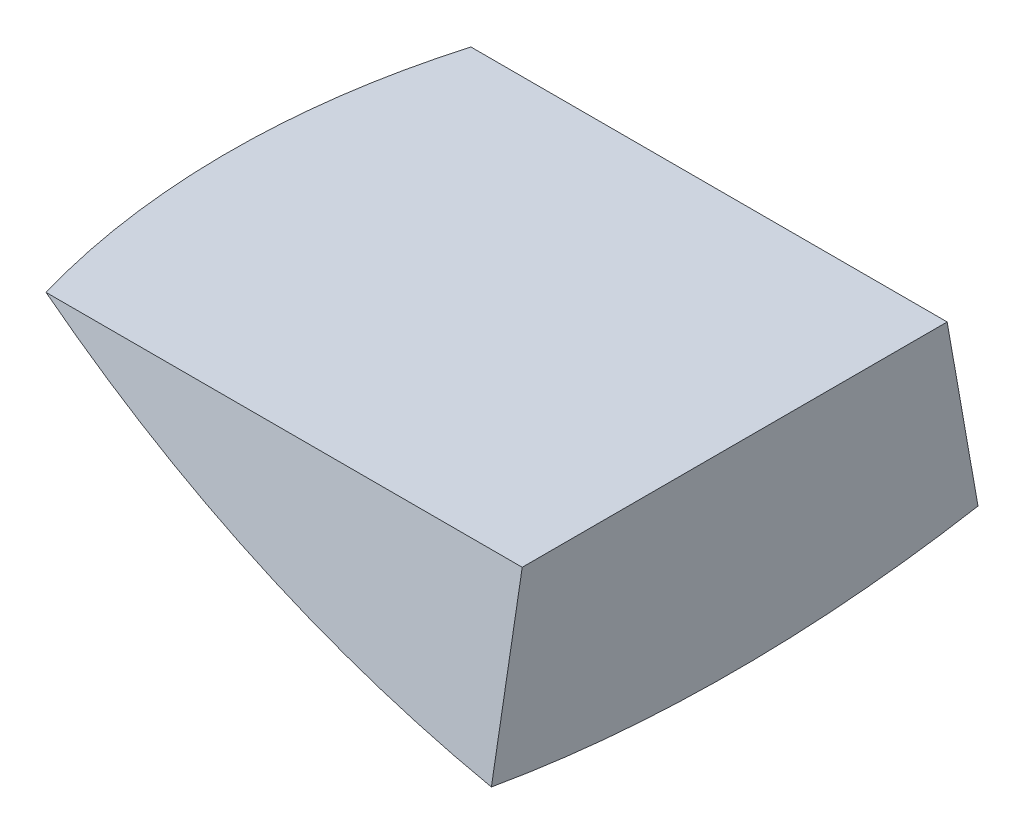
ISO-10303-21;
HEADER;
FILE_DESCRIPTION(('STEP AP214'),'2;1');
FILE_NAME('part.step','',(''),(''),'','','');
FILE_SCHEMA(('AUTOMOTIVE_DESIGN { 1 0 10303 214 1 1 1 1 }'));
ENDSEC;
DATA;
#1=APPLICATION_CONTEXT('core data for automotive mechanical design processes');
#2=APPLICATION_PROTOCOL_DEFINITION('international standard','automotive_design',2000,#1);
#3=PRODUCT_CONTEXT('',#1,'mechanical');
#4=PRODUCT('Part','Part','',(#3));
#5=PRODUCT_RELATED_PRODUCT_CATEGORY('part','',(#4));
#6=PRODUCT_DEFINITION_FORMATION('','',#4);
#7=PRODUCT_DEFINITION_CONTEXT('part definition',#1,'design');
#8=PRODUCT_DEFINITION('design','',#6,#7);
#9=PRODUCT_DEFINITION_SHAPE('','',#8);
#10=(LENGTH_UNIT() NAMED_UNIT(*) SI_UNIT(.MILLI.,.METRE.));
#11=(NAMED_UNIT(*) PLANE_ANGLE_UNIT() SI_UNIT($,.RADIAN.));
#12=(NAMED_UNIT(*) SI_UNIT($,.STERADIAN.) SOLID_ANGLE_UNIT());
#13=UNCERTAINTY_MEASURE_WITH_UNIT(LENGTH_MEASURE(1.E-05),#10,'distance_accuracy_value','');
#14=(GEOMETRIC_REPRESENTATION_CONTEXT(3) GLOBAL_UNCERTAINTY_ASSIGNED_CONTEXT((#13)) GLOBAL_UNIT_ASSIGNED_CONTEXT((#10,
#11,#12)) REPRESENTATION_CONTEXT('',''));
#15=CARTESIAN_POINT('',(0.,0.,0.));
#16=DIRECTION('',(0.,0.,1.));
#17=DIRECTION('',(1.,0.,0.));
#18=AXIS2_PLACEMENT_3D('',#15,#16,#17);
#19=CARTESIAN_POINT('',(-110.266592818501,-615.705846325504,110.266592818501));
#20=DIRECTION('',(-1.,0.,0.));
#21=DIRECTION('',(0.,-1.,0.));
#22=AXIS2_PLACEMENT_3D('',#19,#20,#21);
#23=PLANE('',#22);
#24=DIRECTION('',(0.,0.984807753012208,0.173648177666931));
#25=VECTOR('',#24,1.);
#26=CARTESIAN_POINT('',(-110.266592818501,-615.705846325504,-110.266592818501));
#27=LINE('',#26,#25);
#28=CARTESIAN_POINT('',(-110.266592818501,-615.705846325504,-110.266592818501));
#29=VERTEX_POINT('',#28);
#30=CARTESIAN_POINT('',(-110.266592818501,-536.452923162752,-96.2921641648929));
#31=VERTEX_POINT('',#30);
#32=EDGE_CURVE('E79',#29,#31,#27,.T.);
#33=ORIENTED_EDGE('',*,*,#32,.T.);
#34=DIRECTION('',(0.,0.,-1.));
#35=VECTOR('',#34,1.);
#36=CARTESIAN_POINT('',(-110.266592818501,-536.452923162752,217.297250177168));
#37=LINE('',#36,#35);
#38=CARTESIAN_POINT('',(-110.266592818501,-536.452923162752,96.292164164893));
#39=VERTEX_POINT('',#38);
#40=EDGE_CURVE('E48',#39,#31,#37,.T.);
#41=ORIENTED_EDGE('',*,*,#40,.F.);
#42=DIRECTION('',(0.,0.984807753012208,-0.173648177666931));
#43=VECTOR('',#42,1.);
#44=CARTESIAN_POINT('',(-110.266592818501,-615.705846325504,110.266592818501));
#45=LINE('',#44,#43);
#46=CARTESIAN_POINT('',(-110.266592818501,-615.705846325504,110.266592818501));
#47=VERTEX_POINT('',#46);
#48=EDGE_CURVE('E77',#47,#39,#45,.T.);
#49=ORIENTED_EDGE('',*,*,#48,.F.);
#50=CARTESIAN_POINT('',(-110.266592818501,9.64707683724784,0.));
#51=DIRECTION('',(1.,0.,0.));
#52=DIRECTION('',(0.,1.,0.));
#53=AXIS2_PLACEMENT_3D('',#50,#51,#52);
#54=CIRCLE('',#53,635.);
#55=EDGE_CURVE('E42',#47,#29,#54,.T.);
#56=ORIENTED_EDGE('',*,*,#55,.T.);
#57=EDGE_LOOP('',(#33,#41,#49,#56));
#58=FACE_BOUND('',#57,.T.);
#59=ADVANCED_FACE('F35',(#58),#23,.F.);
#60=CARTESIAN_POINT('',(0.,9.64707683724786,0.));
#61=DIRECTION('',(1.,0.,0.));
#62=DIRECTION('',(0.,1.,0.));
#63=AXIS2_PLACEMENT_3D('',#60,#61,#62);
#64=DEGENERATE_TOROIDAL_SURFACE('',#63,9.64707683724786,635.,.T.);
#65=CARTESIAN_POINT('',(0.,0.146560774021677,1.67519731260095));
#66=DIRECTION('',(0.,0.173648177666931,0.984807753012208));
#67=DIRECTION('',(-1.,0.,0.));
#68=AXIS2_PLACEMENT_3D('',#65,#66,#67);
#69=CIRCLE('',#68,635.);
#70=CARTESIAN_POINT('',(-326.088367505589,-536.452923162752,96.2921641648928));
#71=VERTEX_POINT('',#70);
#72=EDGE_CURVE('E56',#71,#47,#69,.T.);
#73=ORIENTED_EDGE('',*,*,#72,.F.);
#74=CARTESIAN_POINT('',(-339.76942362452,-536.452923162752,0.));
#75=CARTESIAN_POINT('',(-339.769428722978,-536.452923162752,-4.84295463833446));
#76=CARTESIAN_POINT('',(-339.667699387488,-536.452923162752,-9.68575502193584));
#77=CARTESIAN_POINT('',(-339.26094606988,-536.452923162752,-19.3632294432714));
#78=CARTESIAN_POINT('',(-338.955908021492,-536.452923162752,-24.1979028955253));
#79=CARTESIAN_POINT('',(-338.142922552507,-536.452923162752,-33.8512465812276));
#80=CARTESIAN_POINT('',(-337.634928958928,-536.452923162752,-38.6699129213052));
#81=CARTESIAN_POINT('',(-336.416866039196,-536.452923162752,-48.2816378453036));
#82=CARTESIAN_POINT('',(-335.706796959014,-536.452923162752,-53.0746964603873));
#83=CARTESIAN_POINT('',(-334.084850237135,-536.452923162752,-62.6319996861504));
#84=CARTESIAN_POINT('',(-333.172750315264,-536.452923162752,-67.3962065756387));
#85=CARTESIAN_POINT('',(-331.148692751065,-536.452923162752,-76.8820018702564));
#86=CARTESIAN_POINT('',(-330.036734109234,-536.452923162752,-81.6035900621237));
#87=CARTESIAN_POINT('',(-327.614884685211,-536.452923162752,-90.9953890879961));
#88=CARTESIAN_POINT('',(-326.30500730234,-536.452923162752,-95.6656033771268));
#89=CARTESIAN_POINT('',(-323.489444811329,-536.452923162752,-104.946625772897));
#90=CARTESIAN_POINT('',(-321.983759973113,-536.452923162752,-109.557433961419));
#91=CARTESIAN_POINT('',(-318.779423735756,-536.452923162752,-118.710450079452));
#92=CARTESIAN_POINT('',(-317.080811757509,-536.452923162752,-123.252671809139));
#93=CARTESIAN_POINT('',(-313.493224636082,-536.452923162752,-132.261310051288));
#94=CARTESIAN_POINT('',(-311.604249431441,-536.452923162752,-136.727726539276));
#95=CARTESIAN_POINT('',(-307.639091792968,-536.452923162752,-145.576768922274));
#96=CARTESIAN_POINT('',(-305.562906128039,-536.452923162752,-149.959393369521));
#97=CARTESIAN_POINT('',(-301.226882249332,-536.452923162752,-158.632833162181));
#98=CARTESIAN_POINT('',(-298.967044072024,-536.452923162752,-162.923648525827));
#99=CARTESIAN_POINT('',(-294.268211252309,-536.452923162752,-171.404523640603));
#100=CARTESIAN_POINT('',(-291.829265162082,-536.452923162752,-175.59461029124));
#101=CARTESIAN_POINT('',(-286.775868821859,-536.452923162752,-183.867585083601));
#102=CARTESIAN_POINT('',(-284.161418539305,-536.452923162752,-187.950473205437));
#103=CARTESIAN_POINT('',(-278.76155239655,-536.452923162752,-196.001545735154));
#104=CARTESIAN_POINT('',(-275.97613771324,-536.452923162752,-199.969730932355));
#105=CARTESIAN_POINT('',(-270.239170949563,-536.452923162752,-207.784131640855));
#106=CARTESIAN_POINT('',(-267.287619015234,-536.452923162752,-211.630347259362));
#107=CARTESIAN_POINT('',(-261.237322810408,-536.452923162752,-219.176524102658));
#108=CARTESIAN_POINT('',(-258.139308500958,-536.452923162752,-222.877070603313));
#109=CARTESIAN_POINT('',(-251.789164051317,-536.452923162752,-230.143481893104));
#110=CARTESIAN_POINT('',(-248.537034040391,-536.452923162752,-233.7093467952));
#111=CARTESIAN_POINT('',(-241.884353827301,-536.452923162752,-240.699833788068));
#112=CARTESIAN_POINT('',(-238.483803589214,-536.452923162752,-244.124455844654));
#113=CARTESIAN_POINT('',(-231.540271132769,-536.452923162752,-250.826132869048));
#114=CARTESIAN_POINT('',(-227.997288898594,-536.452923162752,-254.10318782047));
#115=CARTESIAN_POINT('',(-220.775119439575,-536.452923162752,-260.503697600759));
#116=CARTESIAN_POINT('',(-217.095930605336,-536.452923162752,-263.627150613675));
#117=CARTESIAN_POINT('',(-209.607925862827,-536.452923162752,-269.714613541255));
#118=CARTESIAN_POINT('',(-205.799109908179,-536.452923162752,-272.678623398873));
#119=CARTESIAN_POINT('',(-198.058670393566,-536.452923162752,-278.441663368454));
#120=CARTESIAN_POINT('',(-194.12704740586,-536.452923162752,-281.240694249013));
#121=CARTESIAN_POINT('',(-186.14802650805,-536.452923162752,-286.668561262383));
#122=CARTESIAN_POINT('',(-182.100628782029,-536.452923162752,-289.297397665782));
#123=CARTESIAN_POINT('',(-173.931412726657,-536.452923162752,-294.358845280453));
#124=CARTESIAN_POINT('',(-169.810491758008,-536.452923162752,-296.79290496997));
#125=CARTESIAN_POINT('',(-161.469266169482,-536.452923162752,-301.484316973172));
#126=CARTESIAN_POINT('',(-157.248961704159,-536.452923162752,-303.741669561634));
#127=CARTESIAN_POINT('',(-148.716497131806,-536.452923162752,-308.075487899163));
#128=CARTESIAN_POINT('',(-144.404337398178,-536.452923162752,-310.151954383375));
#129=CARTESIAN_POINT('',(-135.695842215571,-536.452923162752,-314.120166713405));
#130=CARTESIAN_POINT('',(-131.299506739114,-536.452923162752,-316.011912498921));
#131=CARTESIAN_POINT('',(-122.430667060548,-536.452923162752,-319.607118279643));
#132=CARTESIAN_POINT('',(-117.95816520999,-536.452923162752,-321.310584075662));
#133=CARTESIAN_POINT('',(-108.944882024787,-536.452923162752,-324.526133357301));
#134=CARTESIAN_POINT('',(-104.404100677416,-536.452923162752,-326.038216807249));
#135=CARTESIAN_POINT('',(-95.2624311293848,-536.452923162752,-328.868185711657));
#136=CARTESIAN_POINT('',(-90.6615430644933,-536.452923162752,-330.186071604685));
#137=CARTESIAN_POINT('',(-81.4079355397135,-536.452923162752,-332.625195020947));
#138=CARTESIAN_POINT('',(-76.7552161379019,-536.452923162752,-333.7464327645));
#139=CARTESIAN_POINT('',(-67.4345544427315,-536.452923162752,-335.784002558927));
#140=CARTESIAN_POINT('',(-62.766873562757,-536.452923162752,-336.701530607992));
#141=CARTESIAN_POINT('',(-53.3969160719588,-536.452923162752,-338.338552286753));
#142=CARTESIAN_POINT('',(-48.6946395004366,-536.452923162752,-339.058046141384));
#143=CARTESIAN_POINT('',(-39.263899436132,-536.452923162752,-340.297671367925));
#144=CARTESIAN_POINT('',(-34.5354360432177,-536.452923162752,-340.817803499605));
#145=CARTESIAN_POINT('',(-25.0607490078317,-536.452923162752,-341.657750132317));
#146=CARTESIAN_POINT('',(-20.3145253606554,-536.452923162752,-341.977564580284));
#147=CARTESIAN_POINT('',(-10.8128882397411,-536.452923162752,-342.416281535476));
#148=CARTESIAN_POINT('',(-6.05747493539603,-536.452923162752,-342.535187711341));
#149=CARTESIAN_POINT('',(3.45412780300762,-536.452923162752,-342.57188006614));
#150=CARTESIAN_POINT('',(8.21031723709752,-536.452923162752,-342.489666236963));
#151=CARTESIAN_POINT('',(17.7149677675572,-536.452923162752,-342.124270383659));
#152=CARTESIAN_POINT('',(22.4634288671175,-536.452923162752,-341.841088442521));
#153=CARTESIAN_POINT('',(31.9441372053,-536.452923162752,-341.074278909072));
#154=CARTESIAN_POINT('',(36.6763844511052,-536.452923162752,-340.590651405575));
#155=CARTESIAN_POINT('',(46.1044769104672,-536.452923162752,-339.425293663173));
#156=CARTESIAN_POINT('',(50.8003833707214,-536.452923162752,-338.744058857033));
#157=CARTESIAN_POINT('',(60.1593096348347,-536.452923162752,-337.184276948185));
#158=CARTESIAN_POINT('',(64.8223294542933,-536.452923162752,-336.305729939077));
#159=CARTESIAN_POINT('',(74.1071967944428,-536.452923162752,-334.352936628233));
#160=CARTESIAN_POINT('',(78.7290444152358,-536.452923162752,-333.278690802437));
#161=CARTESIAN_POINT('',(87.9233867012715,-536.452923162752,-330.936466328788));
#162=CARTESIAN_POINT('',(92.4958813596242,-536.452923162752,-329.668487653889));
#163=CARTESIAN_POINT('',(101.583407220782,-536.452923162752,-326.941123161788));
#164=CARTESIAN_POINT('',(106.098438618762,-536.452923162752,-325.481737994888));
#165=CARTESIAN_POINT('',(115.063073885143,-536.452923162752,-322.374225810012));
#166=CARTESIAN_POINT('',(119.512677759442,-536.452923162752,-320.72609880905));
#167=CARTESIAN_POINT('',(128.338614528639,-536.452923162752,-317.244110724583));
#168=CARTESIAN_POINT('',(132.714947339825,-536.452923162752,-315.410249428892));
#169=CARTESIAN_POINT('',(141.3866341501,-536.452923162752,-311.560138631537));
#170=CARTESIAN_POINT('',(145.681988130142,-536.452923162752,-309.54388908697));
#171=CARTESIAN_POINT('',(154.189230749756,-536.452923162752,-305.330168754298));
#172=CARTESIAN_POINT('',(158.401014057928,-536.452923162752,-303.132485309371));
#173=CARTESIAN_POINT('',(166.728455021933,-536.452923162752,-298.561980588277));
#174=CARTESIAN_POINT('',(170.844112657973,-536.452923162752,-296.189159276048));
#175=CARTESIAN_POINT('',(178.97209517879,-536.452923162752,-291.272696440791));
#176=CARTESIAN_POINT('',(182.984420148641,-536.452923162752,-288.729055058407));
#177=CARTESIAN_POINT('',(190.898741077816,-536.452923162752,-283.475566827991));
#178=CARTESIAN_POINT('',(194.800737036183,-536.452923162752,-280.765719978517));
#179=CARTESIAN_POINT('',(202.487651136336,-536.452923162752,-275.184702813561));
#180=CARTESIAN_POINT('',(206.272568230706,-536.452923162752,-272.313531055474));
#181=CARTESIAN_POINT('',(213.718732512769,-536.452923162752,-266.415073407385));
#182=CARTESIAN_POINT('',(217.37997972648,-536.452923162752,-263.387787550229));
#183=CARTESIAN_POINT('',(224.572500300582,-536.452923162752,-257.182546805996));
#184=CARTESIAN_POINT('',(228.103773319766,-536.452923162752,-254.004591523433));
#185=CARTESIAN_POINT('',(235.030273374652,-536.452923162752,-247.50372752828));
#186=CARTESIAN_POINT('',(238.425500289788,-536.452923162752,-244.180818687233));
#187=CARTESIAN_POINT('',(245.090066853897,-536.452923162752,-237.379709890048));
#188=CARTESIAN_POINT('',(248.358723846882,-536.452923162752,-233.900840963183));
#189=CARTESIAN_POINT('',(254.747209671457,-536.452923162752,-226.809035166932));
#190=CARTESIAN_POINT('',(257.867038373266,-536.452923162752,-223.196098180642));
#191=CARTESIAN_POINT('',(263.952540006145,-536.452923162752,-215.842645863624));
#192=CARTESIAN_POINT('',(266.918212767112,-536.452923162752,-212.102130392127));
#193=CARTESIAN_POINT('',(272.690359416666,-536.452923162752,-204.500224006448));
#194=CARTESIAN_POINT('',(275.496833324763,-536.452923162752,-200.63883310708));
#195=CARTESIAN_POINT('',(280.945918441841,-536.452923162752,-192.801954482027));
#196=CARTESIAN_POINT('',(283.588525012365,-536.452923162752,-188.826463531263));
#197=CARTESIAN_POINT('',(288.705349050323,-536.452923162752,-180.768558853299));
#198=CARTESIAN_POINT('',(291.179566567175,-536.452923162752,-176.686145157479));
#199=CARTESIAN_POINT('',(295.95549095535,-536.452923162752,-168.421608508522));
#200=CARTESIAN_POINT('',(298.257197164175,-536.452923162752,-164.23948517255));
#201=CARTESIAN_POINT('',(302.684269258867,-536.452923162752,-155.782921556701));
#202=CARTESIAN_POINT('',(304.809634897044,-536.452923162752,-151.508481147165));
#203=CARTESIAN_POINT('',(308.896260364747,-536.452923162752,-142.841408864145));
#204=CARTESIAN_POINT('',(310.856123965044,-536.452923162752,-138.44811859716));
#205=CARTESIAN_POINT('',(314.589943414344,-536.452923162752,-129.583233512767));
#206=CARTESIAN_POINT('',(316.363898999972,-536.452923162752,-125.111638584437));
#207=CARTESIAN_POINT('',(319.722967795202,-536.452923162752,-116.098057521734));
#208=CARTESIAN_POINT('',(321.308080349346,-536.452923162752,-111.556071143102));
#209=CARTESIAN_POINT('',(324.286843508286,-536.452923162752,-102.409747327825));
#210=CARTESIAN_POINT('',(325.680494162678,-536.452923162752,-97.8054099073318));
#211=CARTESIAN_POINT('',(328.274103006574,-536.452923162752,-88.5422991613114));
#212=CARTESIAN_POINT('',(329.474053228688,-536.452923162752,-83.8835236050542));
#213=CARTESIAN_POINT('',(331.678233689214,-536.452923162752,-74.5199037562746));
#214=CARTESIAN_POINT('',(332.682463978487,-536.452923162752,-69.8150594757243));
#215=CARTESIAN_POINT('',(334.493576422017,-536.452923162752,-60.3675226768464));
#216=CARTESIAN_POINT('',(335.300457887177,-536.452923162752,-55.6248300264207));
#217=CARTESIAN_POINT('',(336.715562475973,-536.452923162752,-46.1098963217619));
#218=CARTESIAN_POINT('',(337.323785319954,-536.452923162752,-41.3376552259426));
#219=CARTESIAN_POINT('',(338.344556251126,-536.452923162752,-31.7346284533266));
#220=CARTESIAN_POINT('',(338.755540705334,-536.452923162752,-26.9036765002997));
#221=CARTESIAN_POINT('',(339.374067211328,-536.452923162752,-17.2287624705065));
#222=CARTESIAN_POINT('',(339.58160896971,-536.452923162752,-12.3848003749871));
#223=CARTESIAN_POINT('',(339.792910890458,-536.452923162752,-2.69240872948194));
#224=CARTESIAN_POINT('',(339.796670029108,-536.452923162752,2.15602084282418));
#225=CARTESIAN_POINT('',(339.60039789588,-536.452923162752,11.8487516723031));
#226=CARTESIAN_POINT('',(339.400366694055,-536.452923162752,16.6930529308943));
#227=CARTESIAN_POINT('',(338.796834399124,-536.452923162752,26.3690697167181));
#228=CARTESIAN_POINT('',(338.393328913459,-536.452923162752,31.2007849699832));
#229=CARTESIAN_POINT('',(337.38350610404,-536.452923162752,40.8429757669916));
#230=CARTESIAN_POINT('',(336.777188786948,-536.452923162752,45.6534513114327));
#231=CARTESIAN_POINT('',(335.362736335159,-536.452923162752,55.2446419661364));
#232=CARTESIAN_POINT('',(334.554601162389,-536.452923162752,60.0253570707843));
#233=CARTESIAN_POINT('',(332.737841912572,-536.452923162752,69.5485425851815));
#234=CARTESIAN_POINT('',(331.729217742932,-536.452923162752,74.2910129772669));
#235=CARTESIAN_POINT('',(329.510167421107,-536.452923162752,83.7419535073197));
#236=CARTESIAN_POINT('',(328.299206410966,-536.452923162752,88.4502980769309));
#237=CARTESIAN_POINT('',(325.679407192167,-536.452923162752,97.8116145261505));
#238=CARTESIAN_POINT('',(324.270568881901,-536.452923162752,102.464586377324));
#239=CARTESIAN_POINT('',(321.2573685783,-536.452923162752,111.706805053271));
#240=CARTESIAN_POINT('',(319.653005902431,-536.452923162752,116.29605165553));
#241=CARTESIAN_POINT('',(316.251460977504,-536.452923162752,125.402522585491));
#242=CARTESIAN_POINT('',(314.454278769276,-536.452923162752,129.919746928442));
#243=CARTESIAN_POINT('',(310.670161013238,-536.452923162752,138.873936349158));
#244=CARTESIAN_POINT('',(308.683228017226,-536.452923162752,143.310902505292));
#245=CARTESIAN_POINT('',(304.522969280695,-536.452923162752,152.096577592001));
#246=CARTESIAN_POINT('',(302.349643491697,-536.452923162752,156.44528649962));
#247=CARTESIAN_POINT('',(297.820329174529,-536.452923162752,165.046498657211));
#248=CARTESIAN_POINT('',(295.464341320667,-536.452923162752,169.299002262256));
#249=CARTESIAN_POINT('',(290.573754967697,-536.452923162752,177.700033145184));
#250=CARTESIAN_POINT('',(288.039156636211,-536.452923162752,181.848560520644));
#251=CARTESIAN_POINT('',(282.808215227806,-536.452923162752,190.014544275224));
#252=CARTESIAN_POINT('',(280.112698914651,-536.452923162752,194.032530276157));
#253=CARTESIAN_POINT('',(274.553756761566,-536.452923162752,201.950621075954));
#254=CARTESIAN_POINT('',(271.690331068437,-536.452923162752,205.850725977873));
#255=CARTESIAN_POINT('',(265.800544300087,-536.452923162752,213.525901345939));
#256=CARTESIAN_POINT('',(262.774183339488,-536.452923162752,217.300971900042));
#257=CARTESIAN_POINT('',(256.563809633013,-536.452923162752,224.719134243492));
#258=CARTESIAN_POINT('',(253.379796869798,-536.452923162752,228.362226018324));
#259=CARTESIAN_POINT('',(246.859809465914,-536.452923162752,235.509594732632));
#260=CARTESIAN_POINT('',(243.52383937273,-536.452923162752,239.013875820305));
#261=CARTESIAN_POINT('',(236.705736672625,-536.452923162752,245.87724634979));
#262=CARTESIAN_POINT('',(233.223604015093,-536.452923162752,249.236335741325));
#263=CARTESIAN_POINT('',(226.119371949879,-536.452923162752,255.80306211331));
#264=CARTESIAN_POINT('',(222.497273171805,-536.452923162752,259.010699774888));
#265=CARTESIAN_POINT('',(215.119553496434,-536.452923162752,265.268555461891));
#266=CARTESIAN_POINT('',(211.363932811654,-536.452923162752,268.318773737853));
#267=CARTESIAN_POINT('',(203.757607157934,-536.452923162752,274.231437492213));
#268=CARTESIAN_POINT('',(199.907950542938,-536.452923162752,277.095231729549));
#269=CARTESIAN_POINT('',(192.090743814327,-536.452923162752,282.657117437119));
#270=CARTESIAN_POINT('',(188.123193883884,-536.452923162752,285.355209164784));
#271=CARTESIAN_POINT('',(180.077254113815,-536.452923162752,290.580696162823));
#272=CARTESIAN_POINT('',(175.998864696162,-536.452923162752,293.108092082919));
#273=CARTESIAN_POINT('',(167.738492756562,-536.452923162752,297.987518853949));
#274=CARTESIAN_POINT('',(163.556510202233,-536.452923162752,300.339549650064));
#275=CARTESIAN_POINT('',(155.096556584549,-536.452923162752,304.863809457058));
#276=CARTESIAN_POINT('',(150.818588505607,-536.452923162752,307.036044048397));
#277=CARTESIAN_POINT('',(142.174202263847,-536.452923162752,311.196754460661));
#278=CARTESIAN_POINT('',(137.807784080292,-536.452923162752,313.185230238503));
#279=CARTESIAN_POINT('',(128.994356306551,-536.452923162752,316.974713193835));
#280=CARTESIAN_POINT('',(124.54734694737,-536.452923162752,318.775720908582));
#281=CARTESIAN_POINT('',(115.580735561756,-536.452923162752,322.186913322368));
#282=CARTESIAN_POINT('',(111.061133630275,-536.452923162752,323.797098270983));
#283=CARTESIAN_POINT('',(101.989303378761,-536.452923162752,326.813063444985));
#284=CARTESIAN_POINT('',(97.4375236995254,-536.452923162752,328.220193318761));
#285=CARTESIAN_POINT('',(88.2785396916341,-536.452923162752,330.840729022292));
#286=CARTESIAN_POINT('',(83.6713354357891,-536.452923162752,332.054135106511));
#287=CARTESIAN_POINT('',(74.4097439911076,-536.452923162752,334.28498005776));
#288=CARTESIAN_POINT('',(69.7553569959864,-536.452923162752,335.302419729016));
#289=CARTESIAN_POINT('',(60.4077002831196,-536.452923162752,337.139458991924));
#290=CARTESIAN_POINT('',(55.7144305538301,-536.452923162752,337.959058524837));
#291=CARTESIAN_POINT('',(46.2974978960184,-536.452923162752,339.398888359815));
#292=CARTESIAN_POINT('',(41.5738355397001,-536.452923162752,340.019122404207));
#293=CARTESIAN_POINT('',(32.1044904469944,-536.452923162752,341.059095146168));
#294=CARTESIAN_POINT('',(27.3588077087394,-536.452923162752,341.478833826732));
#295=CARTESIAN_POINT('',(17.8539323601261,-536.452923162752,342.117038836659));
#296=CARTESIAN_POINT('',(13.0947397625028,-536.452923162752,342.335505355686));
#297=CARTESIAN_POINT('',(3.57137438119235,-536.452923162752,342.570762222652));
#298=CARTESIAN_POINT('',(-1.19279839921125,-536.452923162752,342.587552703473));
#299=CARTESIAN_POINT('',(-10.700284136157,-536.452923162752,342.419732418167));
#300=CARTESIAN_POINT('',(-15.4436100154893,-536.452923162752,342.23585283007));
#301=CARTESIAN_POINT('',(-24.9182823105864,-536.452923162752,341.668187714398));
#302=CARTESIAN_POINT('',(-29.6496287345854,-536.452923162752,341.284402324265));
#303=CARTESIAN_POINT('',(-39.0919115118394,-536.452923162752,340.31763204233));
#304=CARTESIAN_POINT('',(-43.8028479242948,-536.452923162752,339.734647728708));
#305=CARTESIAN_POINT('',(-53.1959481345961,-536.452923162752,338.370549781161));
#306=CARTESIAN_POINT('',(-57.8781119272294,-536.452923162752,337.589436111344));
#307=CARTESIAN_POINT('',(-67.205318996838,-536.452923162752,335.830518236872));
#308=CARTESIAN_POINT('',(-71.8503624888914,-536.452923162752,334.852715172712));
#309=CARTESIAN_POINT('',(-81.0951108815703,-536.452923162752,332.702209178542));
#310=CARTESIAN_POINT('',(-85.6948157845081,-536.452923162752,331.529506258472));
#311=CARTESIAN_POINT('',(-94.8407357059026,-536.452923162752,328.991348838672));
#312=CARTESIAN_POINT('',(-99.3869506894012,-536.452923162752,327.625894212978));
#313=CARTESIAN_POINT('',(-108.417840310173,-536.452923162752,324.704733904229));
#314=CARTESIAN_POINT('',(-112.902514945671,-536.452923162752,323.149028215688));
#315=CARTESIAN_POINT('',(-121.802684846771,-536.452923162752,319.850104989293));
#316=CARTESIAN_POINT('',(-126.21817565385,-536.452923162752,318.106875423018));
#317=CARTESIAN_POINT('',(-134.971895698587,-536.452923162752,314.436170576996));
#318=CARTESIAN_POINT('',(-139.310124936211,-536.452923162752,312.508695297169));
#319=CARTESIAN_POINT('',(-147.901683047518,-536.452923162752,308.473017042669));
#320=CARTESIAN_POINT('',(-152.155012018798,-536.452923162752,306.364814275768));
#321=CARTESIAN_POINT('',(-160.56930950694,-536.452923162752,301.971518114044));
#322=CARTESIAN_POINT('',(-164.730278020116,-536.452923162752,299.686424712163));
#323=CARTESIAN_POINT('',(-172.952428636899,-536.452923162752,294.94358354401));
#324=CARTESIAN_POINT('',(-177.013614208174,-536.452923162752,292.485841789122));
#325=CARTESIAN_POINT('',(-185.02926269091,-536.452923162752,287.402092197308));
#326=CARTESIAN_POINT('',(-188.983725621302,-536.452923162752,284.77608439023));
#327=CARTESIAN_POINT('',(-196.779058470456,-536.452923162752,279.360552040244));
#328=CARTESIAN_POINT('',(-200.619928254854,-536.452923162752,276.571027303931));
#329=CARTESIAN_POINT('',(-208.181417395515,-536.452923162752,270.833500299652));
#330=CARTESIAN_POINT('',(-211.902036670864,-536.452923162752,267.885497925056));
#331=CARTESIAN_POINT('',(-219.229736630464,-536.452923162752,261.825464575208));
#332=CARTESIAN_POINT('',(-222.836361718173,-536.452923162752,258.712882689374));
#333=CARTESIAN_POINT('',(-229.915787536963,-536.452923162752,252.339080441856));
#334=CARTESIAN_POINT('',(-233.388588182346,-536.452923162752,249.077859984992));
#335=CARTESIAN_POINT('',(-240.194395551633,-536.452923162752,242.412650668846));
#336=CARTESIAN_POINT('',(-243.527401678559,-536.452923162752,239.00866120001));
#337=CARTESIAN_POINT('',(-250.047889231072,-536.452923162752,232.064049537833));
#338=CARTESIAN_POINT('',(-253.235370663121,-536.452923162752,228.523427350559));
#339=CARTESIAN_POINT('',(-259.460224750878,-536.452923162752,221.310908966114));
#340=CARTESIAN_POINT('',(-262.497556033416,-536.452923162752,217.638977062221));
#341=CARTESIAN_POINT('',(-268.416016751188,-536.452923162752,210.171321234925));
#342=CARTESIAN_POINT('',(-271.297146212718,-536.452923162752,206.375597332364));
#343=CARTESIAN_POINT('',(-276.898306716675,-536.452923162752,198.667163359369));
#344=CARTESIAN_POINT('',(-279.618339659503,-536.452923162752,194.754454669784));
#345=CARTESIAN_POINT('',(-284.892778814254,-536.452923162752,186.818951935388));
#346=CARTESIAN_POINT('',(-287.447184859739,-536.452923162752,182.796157779958));
#347=CARTESIAN_POINT('',(-292.404467448137,-536.452923162752,174.617303270998));
#348=CARTESIAN_POINT('',(-294.806076331763,-536.452923162752,170.460474525401));
#349=CARTESIAN_POINT('',(-299.432826613282,-536.452923162752,162.049733853956));
#350=CARTESIAN_POINT('',(-301.657967541127,-536.452923162752,157.795821669551));
#351=CARTESIAN_POINT('',(-305.928200011263,-536.452923162752,149.198201616806));
#352=CARTESIAN_POINT('',(-307.973279048984,-536.452923162752,144.854487537913));
#353=CARTESIAN_POINT('',(-311.879800499996,-536.452923162752,136.085283105359));
#354=CARTESIAN_POINT('',(-313.74124386164,-536.452923162752,131.659793174156));
#355=CARTESIAN_POINT('',(-317.275575767578,-536.452923162752,122.739510520041));
#356=CARTESIAN_POINT('',(-318.948659578839,-536.452923162752,118.244795161868));
#357=CARTESIAN_POINT('',(-322.105767974194,-536.452923162752,109.189450062121));
#358=CARTESIAN_POINT('',(-323.589792253345,-536.452923162752,104.628820214243));
#359=CARTESIAN_POINT('',(-326.366053526104,-536.452923162752,95.4506282320399));
#360=CARTESIAN_POINT('',(-327.658332607274,-536.452923162752,90.8330788331252));
#361=CARTESIAN_POINT('',(-330.049297493712,-536.452923162752,81.5485449483677));
#362=CARTESIAN_POINT('',(-331.147996208982,-536.452923162752,76.8815637811855));
#363=CARTESIAN_POINT('',(-333.414898087788,-536.452923162752,66.2660077950564));
#364=CARTESIAN_POINT('',(-334.524661801285,-536.452923162752,60.3048575165164));
#365=CARTESIAN_POINT('',(-336.428878890051,-536.452923162752,48.3338632363107));
#366=CARTESIAN_POINT('',(-337.223400561779,-536.452923162752,42.3240300698951));
#367=CARTESIAN_POINT('',(-338.495488666354,-536.452923162752,30.270888024343));
#368=CARTESIAN_POINT('',(-338.973053798853,-536.452923162752,24.2275790079708));
#369=CARTESIAN_POINT('',(-339.610052999696,-536.452923162752,12.1227685861221));
#370=CARTESIAN_POINT('',(-339.769417243477,-536.452923162752,6.06126347996154));
#371=CARTESIAN_POINT('',(-339.76942362452,-536.452923162752,0.));
#372=B_SPLINE_CURVE_WITH_KNOTS('',3,(#74,#75,#76,#77,#78,#79,#80,#81,#82,#83,#84,#85,#86,#87,
#88,#89,#90,#91,#92,#93,#94,#95,#96,#97,#98,#99,#100,#101,#102,#103,#104,#105,#106,#107,#108,
#109,#110,#111,#112,#113,#114,#115,#116,#117,#118,#119,#120,#121,#122,#123,#124,#125,#126,#127,
#128,#129,#130,#131,#132,#133,#134,#135,#136,#137,#138,#139,#140,#141,#142,#143,#144,#145,#146,
#147,#148,#149,#150,#151,#152,#153,#154,#155,#156,#157,#158,#159,#160,#161,#162,#163,#164,#165,
#166,#167,#168,#169,#170,#171,#172,#173,#174,#175,#176,#177,#178,#179,#180,#181,#182,#183,#184,
#185,#186,#187,#188,#189,#190,#191,#192,#193,#194,#195,#196,#197,#198,#199,#200,#201,#202,#203,
#204,#205,#206,#207,#208,#209,#210,#211,#212,#213,#214,#215,#216,#217,#218,#219,#220,#221,#222,
#223,#224,#225,#226,#227,#228,#229,#230,#231,#232,#233,#234,#235,#236,#237,#238,#239,#240,#241,
#242,#243,#244,#245,#246,#247,#248,#249,#250,#251,#252,#253,#254,#255,#256,#257,#258,#259,#260,
#261,#262,#263,#264,#265,#266,#267,#268,#269,#270,#271,#272,#273,#274,#275,#276,#277,#278,#279,
#280,#281,#282,#283,#284,#285,#286,#287,#288,#289,#290,#291,#292,#293,#294,#295,#296,#297,#298,
#299,#300,#301,#302,#303,#304,#305,#306,#307,#308,#309,#310,#311,#312,#313,#314,#315,#316,#317,
#318,#319,#320,#321,#322,#323,#324,#325,#326,#327,#328,#329,#330,#331,#332,#333,#334,#335,#336,
#337,#338,#339,#340,#341,#342,#343,#344,#345,#346,#347,#348,#349,#350,#351,#352,#353,#354,#355,
#356,#357,#358,#359,#360,#361,#362,#363,#364,#365,#366,#367,#368,#369,#370,#371),.UNSPECIFIED.,
.T.,.F.,(4,2,2,2,2,2,2,2,2,2,2,2,2,2,2,2,2,2,2,2,2,2,2,2,2,2,2,2,2,2,2,2,2,2,2,2,2,2,2,2,2,2,2,
2,2,2,2,2,2,2,2,2,2,2,2,2,2,2,2,2,2,2,2,2,2,2,2,2,2,2,2,2,2,2,2,2,2,2,2,2,2,2,2,2,2,2,2,2,2,2,2,
2,2,2,2,2,2,2,2,2,2,2,2,2,2,2,2,2,2,2,2,2,2,2,2,2,2,2,2,2,2,2,2,2,2,2,2,2,2,2,2,2,2,2,2,2,2,2,2,
2,2,2,2,2,2,2,2,2,4),(0.,14.5275288370298,29.0560628909776,43.5879041129495,58.1197276465236,
72.6676196385337,87.2155843872261,101.762564663383,116.309524886561,130.853518051878,
145.397515912985,159.941764839468,174.486010877667,189.026328744398,203.56664930863,
218.106869790928,232.647077492266,247.121199816297,261.595310000332,276.069423687619,
290.543538982169,305.017825355125,319.492116906794,333.966341021073,348.440542122754,
362.794521054331,377.1484776653,391.502375937154,405.856278894697,420.209739492131,
434.563202764888,448.916633621744,463.27004839727,477.536823124835,491.803581647539,
506.070285798845,520.336993729544,534.603441143557,548.86988913297,563.13633123113,
577.40276700816,591.633739239695,605.864704720415,620.095635591852,634.326568449952,
648.557452959703,662.788336186557,677.019235671069,691.250138502962,705.497964715713,
719.745793862218,733.993611277999,748.24142881739,762.489373784346,776.737315753654,
790.985295123799,805.233287120529,819.54968485924,833.866095081702,848.182521101244,
862.498945366206,876.815774689453,891.132599811106,905.449479911086,919.76638012041,
934.194000453085,948.621641224912,963.049332072272,977.477019182366,991.905299588662,
1006.33357624556,1020.76190328193,1035.19025062921,1049.73116479707,1064.27209993571,
1078.81310812175,1093.35411130943,1107.89542841859,1122.43674505009,1136.97806442491,
1151.51939051543,1166.09978161598,1180.68018020344,1195.26062968941,1209.84107608786,
1224.4213264339,1239.00158057217,1253.58178088908,1268.16196752289,1282.67279711417,
1297.18361401917,1311.69442071623,1326.20522900928,1340.71560333596,1355.22598268714,
1369.73629677406,1384.24658776682,1398.63640374308,1413.02619736316,1427.41593620812,
1441.80567955127,1456.19497610232,1470.58427602689,1484.97353471259,1499.36277457838,
1513.65147058639,1527.94014782555,1542.2287664243,1556.51738926537,1570.80574387627,
1585.09409969902,1599.3824420574,1613.67077500131,1627.90721909534,1642.14365340136,
1656.38004638613,1670.61644194997,1684.85275496704,1699.08906725801,1713.32538885253,
1727.56171085765,1741.79894657406,1756.03618229666,1770.27340165187,1784.51062157517,
1798.74734602306,1812.98406794557,1827.22080670728,1841.45755504816,1855.74541750651,
1870.03328911422,1884.32122173039,1898.60915371206,1912.90100096932,1927.19284582059,
1941.48452204226,1955.77621262536,1970.17414924708,1984.57212421848,1998.97109828362,
2013.36999798392,2027.75383056651,2042.13768634921,2056.51838022819,2070.89811468584,
2089.08011236713,2107.25816880709,2125.43629982398,2143.6184193295),.UNSPECIFIED.);
#373=CARTESIAN_POINT('',(-326.08836750559,-536.452923162752,-96.2921641648929));
#374=VERTEX_POINT('',#373);
#375=EDGE_CURVE('E70',#71,#374,#372,.T.);
#376=ORIENTED_EDGE('',*,*,#375,.T.);
#377=CARTESIAN_POINT('',(0.,0.146560774021677,-1.67519731260095));
#378=DIRECTION('',(0.,-0.173648177666931,0.984807753012208));
#379=DIRECTION('',(-1.,0.,0.));
#380=AXIS2_PLACEMENT_3D('',#377,#378,#379);
#381=CIRCLE('',#380,635.);
#382=EDGE_CURVE('E71',#374,#29,#381,.T.);
#383=ORIENTED_EDGE('',*,*,#382,.T.);
#384=ORIENTED_EDGE('',*,*,#55,.F.);
#385=EDGE_LOOP('',(#73,#376,#383,#384));
#386=FACE_BOUND('',#385,.T.);
#387=ADVANCED_FACE('F90',(#386),#64,.T.);
#388=CARTESIAN_POINT('',(0.,0.146560774021677,1.67519731260095));
#389=DIRECTION('',(0.,-0.173648177666931,-0.984807753012208));
#390=DIRECTION('',(-1.,0.,0.));
#391=AXIS2_PLACEMENT_3D('',#388,#389,#390);
#392=PLANE('',#391);
#393=ORIENTED_EDGE('',*,*,#48,.T.);
#394=DIRECTION('',(-1.,0.,0.));
#395=VECTOR('',#394,1.);
#396=CARTESIAN_POINT('',(0.,-536.452923162752,96.2921641648929));
#397=LINE('',#396,#395);
#398=EDGE_CURVE('E67',#39,#71,#397,.T.);
#399=ORIENTED_EDGE('',*,*,#398,.T.);
#400=ORIENTED_EDGE('',*,*,#72,.T.);
#401=EDGE_LOOP('',(#393,#399,#400));
#402=FACE_BOUND('',#401,.T.);
#403=ADVANCED_FACE('F81',(#402),#392,.F.);
#404=CARTESIAN_POINT('',(0.,0.146560774021677,-1.67519731260095));
#405=DIRECTION('',(0.,0.173648177666931,-0.984807753012208));
#406=DIRECTION('',(-1.,0.,0.));
#407=AXIS2_PLACEMENT_3D('',#404,#405,#406);
#408=PLANE('',#407);
#409=DIRECTION('',(-1.,0.,0.));
#410=VECTOR('',#409,1.);
#411=CARTESIAN_POINT('',(0.,-536.452923162752,-96.2921641648929));
#412=LINE('',#411,#410);
#413=EDGE_CURVE('E11',#31,#374,#412,.T.);
#414=ORIENTED_EDGE('',*,*,#413,.F.);
#415=ORIENTED_EDGE('',*,*,#32,.F.);
#416=ORIENTED_EDGE('',*,*,#382,.F.);
#417=EDGE_LOOP('',(#414,#415,#416));
#418=FACE_BOUND('',#417,.T.);
#419=ADVANCED_FACE('F96',(#418),#408,.T.);
#420=CARTESIAN_POINT('',(-359.037429077349,-536.452923162752,217.297250177168));
#421=DIRECTION('',(0.,-1.,0.));
#422=DIRECTION('',(0.,0.,-1.));
#423=AXIS2_PLACEMENT_3D('',#420,#421,#422);
#424=PLANE('',#423);
#425=ORIENTED_EDGE('',*,*,#40,.T.);
#426=ORIENTED_EDGE('',*,*,#413,.T.);
#427=ORIENTED_EDGE('',*,*,#375,.F.);
#428=ORIENTED_EDGE('',*,*,#398,.F.);
#429=EDGE_LOOP('',(#425,#426,#427,#428));
#430=FACE_BOUND('',#429,.T.);
#431=ADVANCED_FACE('F68',(#430),#424,.F.);
#432=CLOSED_SHELL('',(#59,#387,#403,#419,#431));
#433=MANIFOLD_SOLID_BREP('B2',#432);
#434=ADVANCED_BREP_SHAPE_REPRESENTATION('',(#18,#433),#14);
#435=SHAPE_DEFINITION_REPRESENTATION(#9,#434);
ENDSEC;
END-ISO-10303-21;
